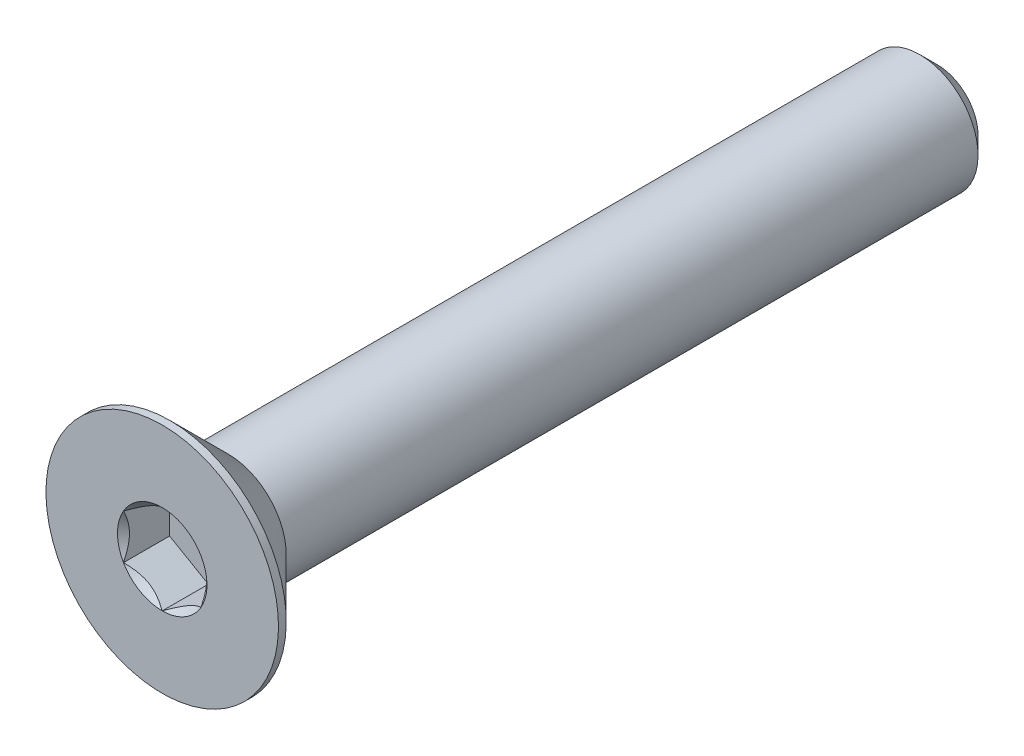
ISO-10303-21;
HEADER;
FILE_DESCRIPTION(('STEP AP214'),'2;1');
FILE_NAME('part.step','',(''),(''),'','','');
FILE_SCHEMA(('AUTOMOTIVE_DESIGN { 1 0 10303 214 1 1 1 1 }'));
ENDSEC;
DATA;
#1=APPLICATION_CONTEXT('core data for automotive mechanical design processes');
#2=APPLICATION_PROTOCOL_DEFINITION('international standard','automotive_design',2000,#1);
#3=PRODUCT_CONTEXT('',#1,'mechanical');
#4=PRODUCT('Part','Part','',(#3));
#5=PRODUCT_RELATED_PRODUCT_CATEGORY('part','',(#4));
#6=PRODUCT_DEFINITION_FORMATION('','',#4);
#7=PRODUCT_DEFINITION_CONTEXT('part definition',#1,'design');
#8=PRODUCT_DEFINITION('design','',#6,#7);
#9=PRODUCT_DEFINITION_SHAPE('','',#8);
#10=(LENGTH_UNIT() NAMED_UNIT(*) SI_UNIT(.MILLI.,.METRE.));
#11=(NAMED_UNIT(*) PLANE_ANGLE_UNIT() SI_UNIT($,.RADIAN.));
#12=(NAMED_UNIT(*) SI_UNIT($,.STERADIAN.) SOLID_ANGLE_UNIT());
#13=UNCERTAINTY_MEASURE_WITH_UNIT(LENGTH_MEASURE(1.E-05),#10,'distance_accuracy_value','');
#14=(GEOMETRIC_REPRESENTATION_CONTEXT(3) GLOBAL_UNCERTAINTY_ASSIGNED_CONTEXT((#13)) GLOBAL_UNIT_ASSIGNED_CONTEXT((#10,
#11,#12)) REPRESENTATION_CONTEXT('',''));
#15=CARTESIAN_POINT('',(0.,0.,0.));
#16=DIRECTION('',(0.,0.,1.));
#17=DIRECTION('',(1.,0.,0.));
#18=AXIS2_PLACEMENT_3D('',#15,#16,#17);
#19=CARTESIAN_POINT('',(0.,0.,-10.));
#20=DIRECTION('',(0.,0.,-1.));
#21=DIRECTION('',(0.,1.,0.));
#22=AXIS2_PLACEMENT_3D('',#19,#20,#21);
#23=CYLINDRICAL_SURFACE('',#22,1.5);
#24=CARTESIAN_POINT('',(0.,0.,8.3));
#25=DIRECTION('',(0.,0.,-1.));
#26=DIRECTION('',(0.,1.,0.));
#27=AXIS2_PLACEMENT_3D('',#24,#25,#26);
#28=CIRCLE('',#27,1.5);
#29=CARTESIAN_POINT('',(0.,1.5,8.3));
#30=VERTEX_POINT('',#29);
#31=EDGE_CURVE('E11',#30,#30,#28,.F.);
#32=ORIENTED_EDGE('',*,*,#31,.F.);
#33=EDGE_LOOP('',(#32));
#34=FACE_BOUND('',#33,.T.);
#35=CARTESIAN_POINT('',(0.,0.,-9.55));
#36=DIRECTION('',(0.,0.,-1.));
#37=DIRECTION('',(0.,1.,0.));
#38=AXIS2_PLACEMENT_3D('',#35,#36,#37);
#39=CIRCLE('',#38,1.5);
#40=CARTESIAN_POINT('',(0.,1.5,-9.55));
#41=VERTEX_POINT('',#40);
#42=EDGE_CURVE('E49',#41,#41,#39,.F.);
#43=ORIENTED_EDGE('',*,*,#42,.T.);
#44=EDGE_LOOP('',(#43));
#45=FACE_BOUND('',#44,.T.);
#46=ADVANCED_FACE('F41',(#34,#45),#23,.T.);
#47=CARTESIAN_POINT('',(0.,1.5,-10.));
#48=DIRECTION('',(0.,0.,-1.));
#49=DIRECTION('',(0.,1.,0.));
#50=AXIS2_PLACEMENT_3D('',#47,#48,#49);
#51=PLANE('',#50);
#52=CARTESIAN_POINT('',(0.,0.,-10.));
#53=DIRECTION('',(0.,0.,-1.));
#54=DIRECTION('',(0.,1.,0.));
#55=AXIS2_PLACEMENT_3D('',#52,#53,#54);
#56=CIRCLE('',#55,1.05);
#57=CARTESIAN_POINT('',(0.,1.05,-10.));
#58=VERTEX_POINT('',#57);
#59=EDGE_CURVE('E153',#58,#58,#56,.T.);
#60=ORIENTED_EDGE('',*,*,#59,.T.);
#61=EDGE_LOOP('',(#60));
#62=FACE_BOUND('',#61,.T.);
#63=ADVANCED_FACE('F162',(#62),#51,.T.);
#64=CARTESIAN_POINT('',(0.,0.,-10.));
#65=DIRECTION('',(0.,0.,1.));
#66=DIRECTION('',(0.,-1.,0.));
#67=AXIS2_PLACEMENT_3D('',#64,#65,#66);
#68=CONICAL_SURFACE('',#67,1.05,0.785398163397448);
#69=ORIENTED_EDGE('',*,*,#42,.F.);
#70=EDGE_LOOP('',(#69));
#71=FACE_BOUND('',#70,.T.);
#72=ORIENTED_EDGE('',*,*,#59,.F.);
#73=EDGE_LOOP('',(#72));
#74=FACE_BOUND('',#73,.T.);
#75=ADVANCED_FACE('F43',(#71,#74),#68,.T.);
#76=CARTESIAN_POINT('',(0.,0.,-10.));
#77=DIRECTION('',(0.,0.,-1.));
#78=DIRECTION('',(0.,1.,0.));
#79=AXIS2_PLACEMENT_3D('',#76,#77,#78);
#80=CYLINDRICAL_SURFACE('',#79,3.);
#81=CARTESIAN_POINT('',(0.,0.,10.));
#82=DIRECTION('',(0.,0.,-1.));
#83=DIRECTION('',(0.,1.,0.));
#84=AXIS2_PLACEMENT_3D('',#81,#82,#83);
#85=CIRCLE('',#84,3.);
#86=CARTESIAN_POINT('',(0.,3.,10.));
#87=VERTEX_POINT('',#86);
#88=EDGE_CURVE('E133',#87,#87,#85,.T.);
#89=ORIENTED_EDGE('',*,*,#88,.T.);
#90=EDGE_LOOP('',(#89));
#91=FACE_BOUND('',#90,.T.);
#92=CARTESIAN_POINT('',(0.,0.,9.79999999999999));
#93=DIRECTION('',(0.,0.,-1.));
#94=DIRECTION('',(0.,1.,0.));
#95=AXIS2_PLACEMENT_3D('',#92,#93,#94);
#96=CIRCLE('',#95,3.);
#97=CARTESIAN_POINT('',(0.,3.,9.79999999999999));
#98=VERTEX_POINT('',#97);
#99=EDGE_CURVE('E130',#98,#98,#96,.T.);
#100=ORIENTED_EDGE('',*,*,#99,.F.);
#101=EDGE_LOOP('',(#100));
#102=FACE_BOUND('',#101,.T.);
#103=ADVANCED_FACE('F161',(#91,#102),#80,.T.);
#104=CARTESIAN_POINT('',(0.,0.,8.3));
#105=DIRECTION('',(0.,0.,1.));
#106=DIRECTION('',(0.,-1.,0.));
#107=AXIS2_PLACEMENT_3D('',#104,#105,#106);
#108=CONICAL_SURFACE('',#107,1.5,0.785398163397451);
#109=ORIENTED_EDGE('',*,*,#99,.T.);
#110=EDGE_LOOP('',(#109));
#111=FACE_BOUND('',#110,.T.);
#112=ORIENTED_EDGE('',*,*,#31,.T.);
#113=EDGE_LOOP('',(#112));
#114=FACE_BOUND('',#113,.T.);
#115=ADVANCED_FACE('F175',(#111,#114),#108,.T.);
#116=CARTESIAN_POINT('',(0.,0.,10.));
#117=DIRECTION('',(0.,0.,1.));
#118=DIRECTION('',(0.,-1.,0.));
#119=AXIS2_PLACEMENT_3D('',#116,#117,#118);
#120=PLANE('',#119);
#121=CARTESIAN_POINT('',(0.,0.,10.));
#122=DIRECTION('',(0.,0.,1.));
#123=DIRECTION('',(1.,0.,0.));
#124=AXIS2_PLACEMENT_3D('',#121,#122,#123);
#125=CIRCLE('',#124,1.15470053837925);
#126=CARTESIAN_POINT('',(1.,0.577350269189631,10.));
#127=VERTEX_POINT('',#126);
#128=CARTESIAN_POINT('',(0.,1.15470053837926,10.));
#129=VERTEX_POINT('',#128);
#130=EDGE_CURVE('E100',#127,#129,#125,.T.);
#131=ORIENTED_EDGE('',*,*,#130,.F.);
#132=CARTESIAN_POINT('',(0.,0.,10.));
#133=DIRECTION('',(0.,0.,1.));
#134=DIRECTION('',(1.,0.,0.));
#135=AXIS2_PLACEMENT_3D('',#132,#133,#134);
#136=CIRCLE('',#135,1.15470053837925);
#137=CARTESIAN_POINT('',(0.999999999999989,-0.577350269189633,10.));
#138=VERTEX_POINT('',#137);
#139=EDGE_CURVE('E112',#138,#127,#136,.T.);
#140=ORIENTED_EDGE('',*,*,#139,.F.);
#141=CARTESIAN_POINT('',(0.,0.,10.));
#142=DIRECTION('',(0.,0.,1.));
#143=DIRECTION('',(1.,0.,0.));
#144=AXIS2_PLACEMENT_3D('',#141,#142,#143);
#145=CIRCLE('',#144,1.15470053837925);
#146=CARTESIAN_POINT('',(0.,-1.15470053837924,10.));
#147=VERTEX_POINT('',#146);
#148=EDGE_CURVE('E246',#147,#138,#145,.T.);
#149=ORIENTED_EDGE('',*,*,#148,.F.);
#150=CARTESIAN_POINT('',(0.,0.,10.));
#151=DIRECTION('',(0.,0.,1.));
#152=DIRECTION('',(1.,0.,0.));
#153=AXIS2_PLACEMENT_3D('',#150,#151,#152);
#154=CIRCLE('',#153,1.15470053837925);
#155=CARTESIAN_POINT('',(-1.,-0.577350269189614,10.));
#156=VERTEX_POINT('',#155);
#157=EDGE_CURVE('E125',#156,#147,#154,.T.);
#158=ORIENTED_EDGE('',*,*,#157,.F.);
#159=CARTESIAN_POINT('',(0.,0.,10.));
#160=DIRECTION('',(0.,0.,1.));
#161=DIRECTION('',(1.,0.,0.));
#162=AXIS2_PLACEMENT_3D('',#159,#160,#161);
#163=CIRCLE('',#162,1.15470053837925);
#164=CARTESIAN_POINT('',(-1.,0.577350269189625,10.));
#165=VERTEX_POINT('',#164);
#166=EDGE_CURVE('E247',#165,#156,#163,.T.);
#167=ORIENTED_EDGE('',*,*,#166,.F.);
#168=CARTESIAN_POINT('',(0.,0.,10.));
#169=DIRECTION('',(0.,0.,1.));
#170=DIRECTION('',(1.,0.,0.));
#171=AXIS2_PLACEMENT_3D('',#168,#169,#170);
#172=CIRCLE('',#171,1.15470053837925);
#173=EDGE_CURVE('E115',#129,#165,#172,.T.);
#174=ORIENTED_EDGE('',*,*,#173,.F.);
#175=EDGE_LOOP('',(#131,#140,#149,#158,#167,#174));
#176=FACE_BOUND('',#175,.T.);
#177=ORIENTED_EDGE('',*,*,#88,.F.);
#178=EDGE_LOOP('',(#177));
#179=FACE_BOUND('',#178,.T.);
#180=ADVANCED_FACE('F109',(#176,#179),#120,.T.);
#181=CARTESIAN_POINT('',(1.,0.577350269189626,8.81));
#182=DIRECTION('',(0.5,0.866025403784438,0.));
#183=DIRECTION('',(-0.866025403784439,0.5,0.));
#184=AXIS2_PLACEMENT_3D('',#181,#182,#183);
#185=PLANE('',#184);
#186=DIRECTION('',(0.,0.,1.));
#187=VECTOR('',#186,1.);
#188=CARTESIAN_POINT('',(1.,0.577350269189626,8.81));
#189=LINE('',#188,#187);
#190=CARTESIAN_POINT('',(1.,0.577350269189626,8.81));
#191=VERTEX_POINT('',#190);
#192=EDGE_CURVE('E56',#191,#127,#189,.T.);
#193=ORIENTED_EDGE('',*,*,#192,.T.);
#194=CARTESIAN_POINT('',(-0.000199999999999558,1.15481600843309,10.0001154873726));
#195=CARTESIAN_POINT('',(0.0341825950071809,1.13496520795026,9.98027793082573));
#196=CARTESIAN_POINT('',(0.0691401181398251,1.11478247255942,9.96160502063888));
#197=CARTESIAN_POINT('',(0.140422802956089,1.07362739529219,9.92741474272315));
#198=CARTESIAN_POINT('',(0.176754750528984,1.0526511355808,9.91191640902345));
#199=CARTESIAN_POINT('',(0.25001661380331,1.01035337909803,9.88536730714226));
#200=CARTESIAN_POINT('',(0.286927851445412,0.989042666109242,9.87424977399692));
#201=CARTESIAN_POINT('',(0.361562729310857,0.945952199282693,9.85711986577618));
#202=CARTESIAN_POINT('',(0.399284088108633,0.924173762626599,9.85109469746667));
#203=CARTESIAN_POINT('',(0.46429219841793,0.886641312640017,9.84566055496749));
#204=CARTESIAN_POINT('',(0.491494371528169,0.870936130672278,9.84485693831673));
#205=CARTESIAN_POINT('',(0.545846040669108,0.839556179862851,9.84620669941688));
#206=CARTESIAN_POINT('',(0.572995523754872,0.823881418494926,9.8483607295472));
#207=CARTESIAN_POINT('',(0.654056277326955,0.77708097059937,9.85911697212847));
#208=CARTESIAN_POINT('',(0.707564140978422,0.746188191116434,9.87201455641535));
#209=CARTESIAN_POINT('',(0.801476065143427,0.691968116419652,9.90314073060217));
#210=CARTESIAN_POINT('',(0.842320523671831,0.668386557293374,9.91973779770183));
#211=CARTESIAN_POINT('',(0.922409637381942,0.622147085933683,9.95712492468529));
#212=CARTESIAN_POINT('',(0.961659010870436,0.599486449584576,9.9779013418174));
#213=CARTESIAN_POINT('',(1.0002,0.577234799135789,10.0001154873726));
#214=B_SPLINE_CURVE_WITH_KNOTS('',3,(#194,#195,#196,#197,#198,#199,#200,#201,#202,#203,#204,
#205,#206,#207,#208,#209,#210,#211,#212,#213),.UNSPECIFIED.,.F.,.F.,(4,2,2,2,2,2,2,2,2,4),(0.,
0.133237676828559,0.267252229834488,0.399137076269297,0.530689603280764,0.624814864263841,
0.718960890149127,0.90730662611209,1.05710100361789,1.20641411519286),.UNSPECIFIED.);
#215=EDGE_CURVE('E97',#129,#127,#214,.T.);
#216=ORIENTED_EDGE('',*,*,#215,.F.);
#217=DIRECTION('',(0.,0.,1.));
#218=VECTOR('',#217,1.);
#219=CARTESIAN_POINT('',(0.,1.15470053837925,8.81));
#220=LINE('',#219,#218);
#221=CARTESIAN_POINT('',(0.,1.15470053837925,8.81));
#222=VERTEX_POINT('',#221);
#223=EDGE_CURVE('E149',#222,#129,#220,.T.);
#224=ORIENTED_EDGE('',*,*,#223,.F.);
#225=DIRECTION('',(-0.866025403784439,0.5,0.));
#226=VECTOR('',#225,1.);
#227=CARTESIAN_POINT('',(1.,0.577350269189626,8.81));
#228=LINE('',#227,#226);
#229=EDGE_CURVE('E122',#191,#222,#228,.T.);
#230=ORIENTED_EDGE('',*,*,#229,.F.);
#231=EDGE_LOOP('',(#193,#216,#224,#230));
#232=FACE_BOUND('',#231,.T.);
#233=ADVANCED_FACE('F127',(#232),#185,.F.);
#234=CARTESIAN_POINT('',(1.,-0.577350269189627,8.81));
#235=DIRECTION('',(1.,0.,0.));
#236=DIRECTION('',(0.,0.,-1.));
#237=AXIS2_PLACEMENT_3D('',#234,#235,#236);
#238=PLANE('',#237);
#239=DIRECTION('',(0.,0.,1.));
#240=VECTOR('',#239,1.);
#241=CARTESIAN_POINT('',(1.,-0.577350269189627,8.81));
#242=LINE('',#241,#240);
#243=CARTESIAN_POINT('',(1.,-0.577350269189627,8.81));
#244=VERTEX_POINT('',#243);
#245=EDGE_CURVE('E64',#244,#138,#242,.T.);
#246=ORIENTED_EDGE('',*,*,#245,.T.);
#247=CARTESIAN_POINT('',(1.,-1.15147208646462,10.3703856775139));
#248=CARTESIAN_POINT('',(1.,-1.12343447988552,10.3492199198737));
#249=CARTESIAN_POINT('',(1.,-1.09524064850698,10.3282616921759));
#250=CARTESIAN_POINT('',(1.,-1.03847715644377,10.2868460222356));
#251=CARTESIAN_POINT('',(1.,-1.00990740382975,10.2663887061237));
#252=CARTESIAN_POINT('',(1.,-0.92312089433348,10.2056047949545));
#253=CARTESIAN_POINT('',(1.,-0.864253173759062,10.1661922289614));
#254=CARTESIAN_POINT('',(1.,-0.740809858258047,10.0888206642002));
#255=CARTESIAN_POINT('',(1.,-0.676100255137808,10.0510730391143));
#256=CARTESIAN_POINT('',(1.,-0.543448939049124,9.9820245875513));
#257=CARTESIAN_POINT('',(1.,-0.475519112027777,9.95070202784687));
#258=CARTESIAN_POINT('',(1.,-0.373555850333526,9.9123817788838));
#259=CARTESIAN_POINT('',(1.,-0.341031989670905,9.90138359164216));
#260=CARTESIAN_POINT('',(1.,-0.27519907905229,9.88199834214736));
#261=CARTESIAN_POINT('',(1.,-0.241889975173929,9.8736114597767));
#262=CARTESIAN_POINT('',(1.,-0.175247517042989,9.86002522071902));
#263=CARTESIAN_POINT('',(1.,-0.141925568218171,9.85477079076797));
#264=CARTESIAN_POINT('',(1.,-0.0749144362322743,9.84754868657089));
#265=CARTESIAN_POINT('',(1.,-0.041225197850157,9.84558151361051));
#266=CARTESIAN_POINT('',(1.,0.024958099263426,9.84508319839316));
#267=CARTESIAN_POINT('',(1.,0.0574512826460445,9.84643026788864));
#268=CARTESIAN_POINT('',(1.,0.122148505701872,9.85221648449899));
#269=CARTESIAN_POINT('',(1.,0.154352610132932,9.85665492066154));
#270=CARTESIAN_POINT('',(1.,0.218799898867646,9.8684568301452));
#271=CARTESIAN_POINT('',(1.,0.25103374326896,9.87587054103851));
#272=CARTESIAN_POINT('',(1.,0.314797132354925,9.89322894249868));
#273=CARTESIAN_POINT('',(1.,0.346326735731011,9.90317342128883));
#274=CARTESIAN_POINT('',(1.,0.445594187730211,9.93822348255434));
#275=CARTESIAN_POINT('',(1.,0.511919139476043,9.96732085835672));
#276=CARTESIAN_POINT('',(1.,0.641453244657539,10.0320153296865));
#277=CARTESIAN_POINT('',(1.,0.704650133126351,10.0676357767152));
#278=CARTESIAN_POINT('',(1.,0.825428490174993,10.1411239013469));
#279=CARTESIAN_POINT('',(1.,0.883132947867691,10.1787919471355));
#280=CARTESIAN_POINT('',(1.,0.968148853704571,10.2370228529432));
#281=CARTESIAN_POINT('',(1.,0.996120570380291,10.2566384757629));
#282=CARTESIAN_POINT('',(1.,1.05168177729902,10.2963885170613));
#283=CARTESIAN_POINT('',(1.,1.07927136997701,10.3165227921988));
#284=CARTESIAN_POINT('',(1.,1.1067018534633,10.336872119073));
#285=B_SPLINE_CURVE_WITH_KNOTS('',3,(#247,#248,#249,#250,#251,#252,#253,#254,#255,#256,#257,
#258,#259,#260,#261,#262,#263,#264,#265,#266,#267,#268,#269,#270,#271,#272,#273,#274,#275,#276,
#277,#278,#279,#280,#281,#282,#283,#284),.UNSPECIFIED.,.F.,.F.,(4,2,2,2,2,2,2,2,2,2,2,2,2,2,2,2,
2,2,4),(0.,0.105386459083292,0.210799187330128,0.423233611565475,0.647793540908512,
0.871580877738622,0.974493074181433,1.07741235827203,1.17846428203206,1.27953161415764,
1.37694086739612,1.47432772585409,1.57343322804295,1.67253043972853,1.88917353996829,
2.10660791038815,2.31323734249845,2.41572589232046,2.51818641476505),.UNSPECIFIED.);
#286=EDGE_CURVE('E121',#127,#138,#285,.F.);
#287=ORIENTED_EDGE('',*,*,#286,.F.);
#288=ORIENTED_EDGE('',*,*,#192,.F.);
#289=DIRECTION('',(0.,1.,0.));
#290=VECTOR('',#289,1.);
#291=CARTESIAN_POINT('',(1.,-0.577350269189627,8.81));
#292=LINE('',#291,#290);
#293=EDGE_CURVE('E138',#244,#191,#292,.T.);
#294=ORIENTED_EDGE('',*,*,#293,.F.);
#295=EDGE_LOOP('',(#246,#287,#288,#294));
#296=FACE_BOUND('',#295,.T.);
#297=ADVANCED_FACE('F124',(#296),#238,.F.);
#298=CARTESIAN_POINT('',(0.,-1.15470053837925,8.81));
#299=DIRECTION('',(0.5,-0.866025403784439,0.));
#300=DIRECTION('',(0.866025403784439,0.5,0.));
#301=AXIS2_PLACEMENT_3D('',#298,#299,#300);
#302=PLANE('',#301);
#303=DIRECTION('',(0.,0.,1.));
#304=VECTOR('',#303,1.);
#305=CARTESIAN_POINT('',(0.,-1.15470053837925,8.81));
#306=LINE('',#305,#304);
#307=CARTESIAN_POINT('',(0.,-1.15470053837925,8.81));
#308=VERTEX_POINT('',#307);
#309=EDGE_CURVE('E135',#308,#147,#306,.T.);
#310=ORIENTED_EDGE('',*,*,#309,.T.);
#311=CARTESIAN_POINT('',(1.0002,-0.577234799135789,10.0001154873726));
#312=CARTESIAN_POINT('',(0.965817404992819,-0.597085599618622,9.98027793082574));
#313=CARTESIAN_POINT('',(0.930859881860175,-0.617268335009457,9.9616050206389));
#314=CARTESIAN_POINT('',(0.859577197043911,-0.658423412276686,9.92741474272317));
#315=CARTESIAN_POINT('',(0.823245249471016,-0.67939967198808,9.91191640902347));
#316=CARTESIAN_POINT('',(0.74998338619669,-0.721697428470846,9.88536730714227));
#317=CARTESIAN_POINT('',(0.713072148554587,-0.743008141459637,9.87424977399693));
#318=CARTESIAN_POINT('',(0.638437270689143,-0.786098608286186,9.85711986577619));
#319=CARTESIAN_POINT('',(0.600715911891367,-0.80787704494228,9.85109469746668));
#320=CARTESIAN_POINT('',(0.535707801582069,-0.845409494928862,9.8456605549675));
#321=CARTESIAN_POINT('',(0.50850562847183,-0.861114676896601,9.84485693831674));
#322=CARTESIAN_POINT('',(0.45415395933089,-0.892494627706028,9.8462066994169));
#323=CARTESIAN_POINT('',(0.427004476245126,-0.908169389073953,9.84836072954721));
#324=CARTESIAN_POINT('',(0.345943722673041,-0.95496983696951,9.85911697212848));
#325=CARTESIAN_POINT('',(0.292435859021573,-0.985862616452447,9.87201455641537));
#326=CARTESIAN_POINT('',(0.198523934856569,-1.04008269114923,9.90314073060219));
#327=CARTESIAN_POINT('',(0.157679476328166,-1.06366425027551,9.91973779770185));
#328=CARTESIAN_POINT('',(0.0775903626180562,-1.1099037216352,9.9571249246853));
#329=CARTESIAN_POINT('',(0.0383409891295623,-1.1325643579843,9.97790134181741));
#330=CARTESIAN_POINT('',(-0.000199999999999948,-1.15481600843309,10.0001154873726));
#331=B_SPLINE_CURVE_WITH_KNOTS('',3,(#311,#312,#313,#314,#315,#316,#317,#318,#319,#320,#321,
#322,#323,#324,#325,#326,#327,#328,#329,#330),.UNSPECIFIED.,.F.,.F.,(4,2,2,2,2,2,2,2,2,4),(0.,
0.133237676828558,0.267252229834488,0.399137076269297,0.530689603280764,0.624814864263842,
0.71896089014913,0.907306626112095,1.05710100361789,1.20641411519286),.UNSPECIFIED.);
#332=EDGE_CURVE('E244',#138,#147,#331,.T.);
#333=ORIENTED_EDGE('',*,*,#332,.F.);
#334=ORIENTED_EDGE('',*,*,#245,.F.);
#335=DIRECTION('',(0.866025403784439,0.5,0.));
#336=VECTOR('',#335,1.);
#337=CARTESIAN_POINT('',(0.,-1.15470053837925,8.81));
#338=LINE('',#337,#336);
#339=EDGE_CURVE('E236',#308,#244,#338,.T.);
#340=ORIENTED_EDGE('',*,*,#339,.F.);
#341=EDGE_LOOP('',(#310,#333,#334,#340));
#342=FACE_BOUND('',#341,.T.);
#343=ADVANCED_FACE('F201',(#342),#302,.F.);
#344=CARTESIAN_POINT('',(-1.,-0.577350269189626,8.81));
#345=DIRECTION('',(-0.5,-0.866025403784439,0.));
#346=DIRECTION('',(0.866025403784439,-0.5,0.));
#347=AXIS2_PLACEMENT_3D('',#344,#345,#346);
#348=PLANE('',#347);
#349=DIRECTION('',(0.,0.,1.));
#350=VECTOR('',#349,1.);
#351=CARTESIAN_POINT('',(-1.,-0.577350269189626,8.81));
#352=LINE('',#351,#350);
#353=CARTESIAN_POINT('',(-1.,-0.577350269189626,8.81));
#354=VERTEX_POINT('',#353);
#355=EDGE_CURVE('E143',#354,#156,#352,.T.);
#356=ORIENTED_EDGE('',*,*,#355,.T.);
#357=CARTESIAN_POINT('',(0.000199999999999662,-1.15481600843309,10.0001154873726));
#358=CARTESIAN_POINT('',(-0.0341825950071811,-1.13496520795026,9.98027793082574));
#359=CARTESIAN_POINT('',(-0.0691401181398252,-1.11478247255942,9.9616050206389));
#360=CARTESIAN_POINT('',(-0.14042280295609,-1.07362739529219,9.92741474272317));
#361=CARTESIAN_POINT('',(-0.176754750528985,-1.0526511355808,9.91191640902347));
#362=CARTESIAN_POINT('',(-0.250016613803313,-1.01035337909803,9.88536730714227));
#363=CARTESIAN_POINT('',(-0.286927851445416,-0.98904266610924,9.87424977399694));
#364=CARTESIAN_POINT('',(-0.361562729310861,-0.94595219928269,9.85711986577619));
#365=CARTESIAN_POINT('',(-0.399284088108638,-0.924173762626595,9.85109469746668));
#366=CARTESIAN_POINT('',(-0.464292198417937,-0.886641312640013,9.8456605549675));
#367=CARTESIAN_POINT('',(-0.491494371528175,-0.870936130672274,9.84485693831674));
#368=CARTESIAN_POINT('',(-0.545846040669116,-0.839556179862846,9.8462066994169));
#369=CARTESIAN_POINT('',(-0.572995523754879,-0.823881418494921,9.84836072954721));
#370=CARTESIAN_POINT('',(-0.654056277326965,-0.777080970599364,9.85911697212848));
#371=CARTESIAN_POINT('',(-0.707564140978432,-0.746188191116428,9.87201455641537));
#372=CARTESIAN_POINT('',(-0.801476065143436,-0.691968116419647,9.90314073060219));
#373=CARTESIAN_POINT('',(-0.842320523671838,-0.668386557293369,9.91973779770185));
#374=CARTESIAN_POINT('',(-0.922409637381946,-0.62214708593368,9.9571249246853));
#375=CARTESIAN_POINT('',(-0.961659010870439,-0.599486449584575,9.97790134181741));
#376=CARTESIAN_POINT('',(-1.0002,-0.577234799135788,10.0001154873726));
#377=B_SPLINE_CURVE_WITH_KNOTS('',3,(#357,#358,#359,#360,#361,#362,#363,#364,#365,#366,#367,
#368,#369,#370,#371,#372,#373,#374,#375,#376),.UNSPECIFIED.,.F.,.F.,(4,2,2,2,2,2,2,2,2,4),(0.,
0.133237676828559,0.267252229834491,0.399137076269302,0.530689603280771,0.62481486426385,
0.718960890149137,0.907306626112103,1.0571010036179,1.20641411519286),.UNSPECIFIED.);
#378=EDGE_CURVE('E218',#147,#156,#377,.T.);
#379=ORIENTED_EDGE('',*,*,#378,.F.);
#380=ORIENTED_EDGE('',*,*,#309,.F.);
#381=DIRECTION('',(0.866025403784439,-0.5,0.));
#382=VECTOR('',#381,1.);
#383=CARTESIAN_POINT('',(-1.,-0.577350269189626,8.81));
#384=LINE('',#383,#382);
#385=EDGE_CURVE('E234',#354,#308,#384,.T.);
#386=ORIENTED_EDGE('',*,*,#385,.F.);
#387=EDGE_LOOP('',(#356,#379,#380,#386));
#388=FACE_BOUND('',#387,.T.);
#389=ADVANCED_FACE('F197',(#388),#348,.F.);
#390=CARTESIAN_POINT('',(-1.,0.577350269189626,8.81));
#391=DIRECTION('',(-1.,0.,0.));
#392=DIRECTION('',(0.,-1.,0.));
#393=AXIS2_PLACEMENT_3D('',#390,#391,#392);
#394=PLANE('',#393);
#395=DIRECTION('',(0.,0.,1.));
#396=VECTOR('',#395,1.);
#397=CARTESIAN_POINT('',(-1.,0.577350269189626,8.81));
#398=LINE('',#397,#396);
#399=CARTESIAN_POINT('',(-1.,0.577350269189626,8.81));
#400=VERTEX_POINT('',#399);
#401=EDGE_CURVE('E146',#400,#165,#398,.T.);
#402=ORIENTED_EDGE('',*,*,#401,.T.);
#403=CARTESIAN_POINT('',(-1.,-1.15147208646462,10.3703856775139));
#404=CARTESIAN_POINT('',(-1.,-1.12343447988552,10.3492199198737));
#405=CARTESIAN_POINT('',(-1.,-1.09524064850698,10.3282616921759));
#406=CARTESIAN_POINT('',(-1.,-1.03847715644377,10.2868460222356));
#407=CARTESIAN_POINT('',(-1.,-1.00990740382975,10.2663887061237));
#408=CARTESIAN_POINT('',(-1.,-0.923120894333479,10.2056047949545));
#409=CARTESIAN_POINT('',(-1.,-0.864253173759062,10.1661922289614));
#410=CARTESIAN_POINT('',(-1.,-0.740809858258047,10.0888206642002));
#411=CARTESIAN_POINT('',(-1.,-0.676100255137808,10.0510730391143));
#412=CARTESIAN_POINT('',(-1.,-0.543448939049124,9.9820245875513));
#413=CARTESIAN_POINT('',(-1.,-0.475519112027778,9.95070202784687));
#414=CARTESIAN_POINT('',(-1.,-0.373555850333527,9.9123817788838));
#415=CARTESIAN_POINT('',(-1.,-0.341031989670906,9.90138359164216));
#416=CARTESIAN_POINT('',(-1.,-0.27519907905229,9.88199834214736));
#417=CARTESIAN_POINT('',(-1.,-0.24188997517393,9.8736114597767));
#418=CARTESIAN_POINT('',(-1.,-0.175247517042989,9.86002522071902));
#419=CARTESIAN_POINT('',(-1.,-0.141925568218171,9.85477079076797));
#420=CARTESIAN_POINT('',(-1.,-0.0749144362322743,9.8475486865709));
#421=CARTESIAN_POINT('',(-1.,-0.0412251978501566,9.84558151361051));
#422=CARTESIAN_POINT('',(-1.,0.0249580992634268,9.84508319839316));
#423=CARTESIAN_POINT('',(-1.,0.0574512826460453,9.84643026788864));
#424=CARTESIAN_POINT('',(-1.,0.122148505701873,9.85221648449899));
#425=CARTESIAN_POINT('',(-1.,0.154352610132933,9.85665492066154));
#426=CARTESIAN_POINT('',(-1.,0.218799898867647,9.86845683014521));
#427=CARTESIAN_POINT('',(-1.,0.25103374326896,9.87587054103851));
#428=CARTESIAN_POINT('',(-1.,0.314797132354926,9.89322894249868));
#429=CARTESIAN_POINT('',(-1.,0.346326735731012,9.90317342128883));
#430=CARTESIAN_POINT('',(-1.,0.445594187730212,9.93822348255434));
#431=CARTESIAN_POINT('',(-1.,0.511919139476043,9.96732085835673));
#432=CARTESIAN_POINT('',(-1.,0.641453244657538,10.0320153296865));
#433=CARTESIAN_POINT('',(-1.,0.70465013312635,10.0676357767152));
#434=CARTESIAN_POINT('',(-1.,0.825428490174993,10.1411239013469));
#435=CARTESIAN_POINT('',(-1.,0.883132947867691,10.1787919471355));
#436=CARTESIAN_POINT('',(-1.,0.968148853704572,10.2370228529432));
#437=CARTESIAN_POINT('',(-1.,0.996120570380292,10.2566384757629));
#438=CARTESIAN_POINT('',(-1.,1.05168177729902,10.2963885170613));
#439=CARTESIAN_POINT('',(-1.,1.07927136997701,10.3165227921988));
#440=CARTESIAN_POINT('',(-1.,1.1067018534633,10.336872119073));
#441=B_SPLINE_CURVE_WITH_KNOTS('',3,(#403,#404,#405,#406,#407,#408,#409,#410,#411,#412,#413,
#414,#415,#416,#417,#418,#419,#420,#421,#422,#423,#424,#425,#426,#427,#428,#429,#430,#431,#432,
#433,#434,#435,#436,#437,#438,#439,#440),.UNSPECIFIED.,.F.,.F.,(4,2,2,2,2,2,2,2,2,2,2,2,2,2,2,2,
2,2,4),(0.,0.105386459083291,0.210799187330127,0.423233611565474,0.647793540908509,
0.871580877738619,0.974493074181431,1.07741235827202,1.17846428203206,1.27953161415764,
1.37694086739612,1.47432772585409,1.57343322804295,1.67253043972853,1.88917353996829,
2.10660791038814,2.31323734249845,2.41572589232046,2.51818641476505),.UNSPECIFIED.);
#442=EDGE_CURVE('E103',#156,#165,#441,.T.);
#443=ORIENTED_EDGE('',*,*,#442,.F.);
#444=ORIENTED_EDGE('',*,*,#355,.F.);
#445=DIRECTION('',(0.,-1.,0.));
#446=VECTOR('',#445,1.);
#447=CARTESIAN_POINT('',(-1.,0.577350269189626,8.81));
#448=LINE('',#447,#446);
#449=EDGE_CURVE('E231',#400,#354,#448,.T.);
#450=ORIENTED_EDGE('',*,*,#449,.F.);
#451=EDGE_LOOP('',(#402,#443,#444,#450));
#452=FACE_BOUND('',#451,.T.);
#453=ADVANCED_FACE('F193',(#452),#394,.F.);
#454=CARTESIAN_POINT('',(0.,1.15470053837925,8.81));
#455=DIRECTION('',(-0.5,0.866025403784439,0.));
#456=DIRECTION('',(-0.866025403784439,-0.5,0.));
#457=AXIS2_PLACEMENT_3D('',#454,#455,#456);
#458=PLANE('',#457);
#459=ORIENTED_EDGE('',*,*,#223,.T.);
#460=CARTESIAN_POINT('',(-1.0002,0.577234799135788,10.0001154873726));
#461=CARTESIAN_POINT('',(-0.965817404992819,0.597085599618622,9.98027793082573));
#462=CARTESIAN_POINT('',(-0.930859881860175,0.617268335009457,9.96160502063889));
#463=CARTESIAN_POINT('',(-0.859577197043909,0.658423412276687,9.92741474272315));
#464=CARTESIAN_POINT('',(-0.823245249471015,0.679399671988081,9.91191640902345));
#465=CARTESIAN_POINT('',(-0.749983386196687,0.721697428470848,9.88536730714226));
#466=CARTESIAN_POINT('',(-0.713072148554584,0.743008141459638,9.87424977399692));
#467=CARTESIAN_POINT('',(-0.638437270689139,0.786098608286188,9.85711986577618));
#468=CARTESIAN_POINT('',(-0.600715911891362,0.807877044942283,9.85109469746667));
#469=CARTESIAN_POINT('',(-0.535707801582064,0.845409494928865,9.84566055496749));
#470=CARTESIAN_POINT('',(-0.508505628471825,0.861114676896604,9.84485693831673));
#471=CARTESIAN_POINT('',(-0.454153959330886,0.892494627706031,9.84620669941688));
#472=CARTESIAN_POINT('',(-0.427004476245122,0.908169389073956,9.8483607295472));
#473=CARTESIAN_POINT('',(-0.345943722673038,0.954969836969512,9.85911697212847));
#474=CARTESIAN_POINT('',(-0.292435859021571,0.985862616452448,9.87201455641535));
#475=CARTESIAN_POINT('',(-0.198523934856567,1.04008269114923,9.90314073060217));
#476=CARTESIAN_POINT('',(-0.157679476328164,1.06366425027551,9.91973779770183));
#477=CARTESIAN_POINT('',(-0.0775903626180556,1.1099037216352,9.95712492468529));
#478=CARTESIAN_POINT('',(-0.0383409891295621,1.1325643579843,9.9779013418174));
#479=CARTESIAN_POINT('',(0.000199999999999515,1.15481600843309,10.0001154873726));
#480=B_SPLINE_CURVE_WITH_KNOTS('',3,(#460,#461,#462,#463,#464,#465,#466,#467,#468,#469,#470,
#471,#472,#473,#474,#475,#476,#477,#478,#479),.UNSPECIFIED.,.F.,.F.,(4,2,2,2,2,2,2,2,2,4),(0.,
0.13323767682856,0.267252229834492,0.399137076269303,0.530689603280772,0.624814864263849,
0.718960890149135,0.907306626112099,1.0571010036179,1.20641411519286),.UNSPECIFIED.);
#481=EDGE_CURVE('E240',#165,#129,#480,.T.);
#482=ORIENTED_EDGE('',*,*,#481,.F.);
#483=ORIENTED_EDGE('',*,*,#401,.F.);
#484=DIRECTION('',(-0.866025403784439,-0.5,0.));
#485=VECTOR('',#484,1.);
#486=CARTESIAN_POINT('',(0.,1.15470053837925,8.81));
#487=LINE('',#486,#485);
#488=EDGE_CURVE('E228',#222,#400,#487,.T.);
#489=ORIENTED_EDGE('',*,*,#488,.F.);
#490=EDGE_LOOP('',(#459,#482,#483,#489));
#491=FACE_BOUND('',#490,.T.);
#492=ADVANCED_FACE('F189',(#491),#458,.F.);
#493=CARTESIAN_POINT('',(0.,0.,8.81));
#494=DIRECTION('',(0.,0.,1.));
#495=DIRECTION('',(1.,0.,0.));
#496=AXIS2_PLACEMENT_3D('',#493,#494,#495);
#497=PLANE('',#496);
#498=ORIENTED_EDGE('',*,*,#229,.T.);
#499=ORIENTED_EDGE('',*,*,#488,.T.);
#500=ORIENTED_EDGE('',*,*,#449,.T.);
#501=ORIENTED_EDGE('',*,*,#385,.T.);
#502=ORIENTED_EDGE('',*,*,#339,.T.);
#503=ORIENTED_EDGE('',*,*,#293,.T.);
#504=EDGE_LOOP('',(#498,#499,#500,#501,#502,#503));
#505=FACE_BOUND('',#504,.T.);
#506=ADVANCED_FACE('F192',(#505),#497,.T.);
#507=CARTESIAN_POINT('',(0.,0.,10.));
#508=DIRECTION('',(0.,0.,1.));
#509=DIRECTION('',(1.,0.,0.));
#510=AXIS2_PLACEMENT_3D('',#507,#508,#509);
#511=CONICAL_SURFACE('',#510,1.15470053837925,0.78539816339745);
#512=ORIENTED_EDGE('',*,*,#481,.T.);
#513=ORIENTED_EDGE('',*,*,#173,.T.);
#514=EDGE_LOOP('',(#512,#513));
#515=FACE_BOUND('',#514,.T.);
#516=ADVANCED_FACE('F208',(#515),#511,.F.);
#517=CARTESIAN_POINT('',(0.,0.,10.));
#518=DIRECTION('',(0.,0.,1.));
#519=DIRECTION('',(1.,0.,0.));
#520=AXIS2_PLACEMENT_3D('',#517,#518,#519);
#521=CONICAL_SURFACE('',#520,1.15470053837925,0.78539816339745);
#522=ORIENTED_EDGE('',*,*,#378,.T.);
#523=ORIENTED_EDGE('',*,*,#157,.T.);
#524=EDGE_LOOP('',(#522,#523));
#525=FACE_BOUND('',#524,.T.);
#526=ADVANCED_FACE('F210',(#525),#521,.F.);
#527=CARTESIAN_POINT('',(0.,0.,10.));
#528=DIRECTION('',(0.,0.,1.));
#529=DIRECTION('',(1.,0.,0.));
#530=AXIS2_PLACEMENT_3D('',#527,#528,#529);
#531=CONICAL_SURFACE('',#530,1.15470053837925,0.78539816339745);
#532=ORIENTED_EDGE('',*,*,#286,.T.);
#533=ORIENTED_EDGE('',*,*,#139,.T.);
#534=EDGE_LOOP('',(#532,#533));
#535=FACE_BOUND('',#534,.T.);
#536=ADVANCED_FACE('F120',(#535),#531,.F.);
#537=CARTESIAN_POINT('',(0.,0.,10.));
#538=DIRECTION('',(0.,0.,1.));
#539=DIRECTION('',(1.,0.,0.));
#540=AXIS2_PLACEMENT_3D('',#537,#538,#539);
#541=CONICAL_SURFACE('',#540,1.15470053837925,0.78539816339745);
#542=ORIENTED_EDGE('',*,*,#332,.T.);
#543=ORIENTED_EDGE('',*,*,#148,.T.);
#544=EDGE_LOOP('',(#542,#543));
#545=FACE_BOUND('',#544,.T.);
#546=ADVANCED_FACE('F259',(#545),#541,.F.);
#547=CARTESIAN_POINT('',(0.,0.,10.));
#548=DIRECTION('',(0.,0.,1.));
#549=DIRECTION('',(1.,0.,0.));
#550=AXIS2_PLACEMENT_3D('',#547,#548,#549);
#551=CONICAL_SURFACE('',#550,1.15470053837925,0.78539816339745);
#552=ORIENTED_EDGE('',*,*,#442,.T.);
#553=ORIENTED_EDGE('',*,*,#166,.T.);
#554=EDGE_LOOP('',(#552,#553));
#555=FACE_BOUND('',#554,.T.);
#556=ADVANCED_FACE('F264',(#555),#551,.F.);
#557=CARTESIAN_POINT('',(0.,0.,10.));
#558=DIRECTION('',(0.,0.,1.));
#559=DIRECTION('',(1.,0.,0.));
#560=AXIS2_PLACEMENT_3D('',#557,#558,#559);
#561=CONICAL_SURFACE('',#560,1.15470053837925,0.78539816339745);
#562=ORIENTED_EDGE('',*,*,#215,.T.);
#563=ORIENTED_EDGE('',*,*,#130,.T.);
#564=EDGE_LOOP('',(#562,#563));
#565=FACE_BOUND('',#564,.T.);
#566=ADVANCED_FACE('F99',(#565),#561,.F.);
#567=CLOSED_SHELL('',(#46,#63,#75,#103,#115,#180,#233,#297,#343,#389,#453,#492,#506,#516,#526,
#536,#546,#556,#566));
#568=MANIFOLD_SOLID_BREP('B2',#567);
#569=ADVANCED_BREP_SHAPE_REPRESENTATION('',(#18,#568),#14);
#570=SHAPE_DEFINITION_REPRESENTATION(#9,#569);
ENDSEC;
END-ISO-10303-21;
